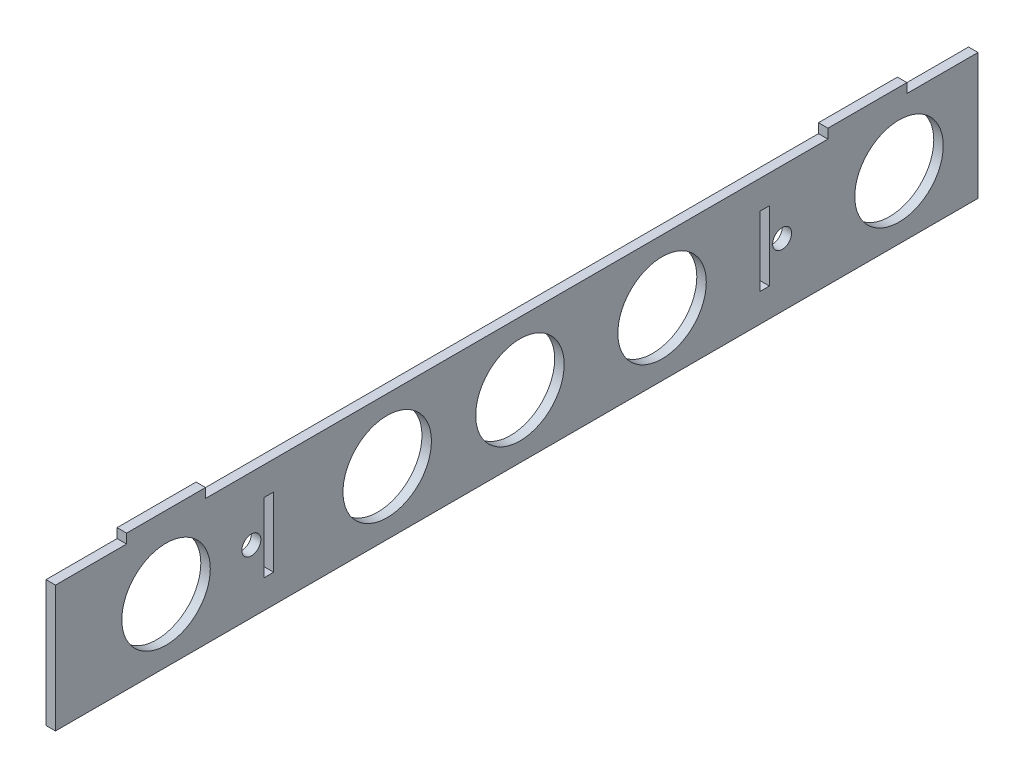
ISO-10303-21;
HEADER;
FILE_DESCRIPTION(('STEP AP214'),'2;1');
FILE_NAME('part.step','',(''),(''),'','','');
FILE_SCHEMA(('AUTOMOTIVE_DESIGN { 1 0 10303 214 1 1 1 1 }'));
ENDSEC;
DATA;
#1=APPLICATION_CONTEXT('core data for automotive mechanical design processes');
#2=APPLICATION_PROTOCOL_DEFINITION('international standard','automotive_design',2000,#1);
#3=PRODUCT_CONTEXT('',#1,'mechanical');
#4=PRODUCT('Part','Part','',(#3));
#5=PRODUCT_RELATED_PRODUCT_CATEGORY('part','',(#4));
#6=PRODUCT_DEFINITION_FORMATION('','',#4);
#7=PRODUCT_DEFINITION_CONTEXT('part definition',#1,'design');
#8=PRODUCT_DEFINITION('design','',#6,#7);
#9=PRODUCT_DEFINITION_SHAPE('','',#8);
#10=(LENGTH_UNIT() NAMED_UNIT(*) SI_UNIT(.MILLI.,.METRE.));
#11=(NAMED_UNIT(*) PLANE_ANGLE_UNIT() SI_UNIT($,.RADIAN.));
#12=(NAMED_UNIT(*) SI_UNIT($,.STERADIAN.) SOLID_ANGLE_UNIT());
#13=UNCERTAINTY_MEASURE_WITH_UNIT(LENGTH_MEASURE(1.E-05),#10,'distance_accuracy_value','');
#14=(GEOMETRIC_REPRESENTATION_CONTEXT(3) GLOBAL_UNCERTAINTY_ASSIGNED_CONTEXT((#13)) GLOBAL_UNIT_ASSIGNED_CONTEXT((#10,
#11,#12)) REPRESENTATION_CONTEXT('',''));
#15=CARTESIAN_POINT('',(0.,0.,0.));
#16=DIRECTION('',(0.,0.,1.));
#17=DIRECTION('',(1.,0.,0.));
#18=AXIS2_PLACEMENT_3D('',#15,#16,#17);
#19=CARTESIAN_POINT('',(3.,-9.,0.));
#20=DIRECTION('',(0.,1.,0.));
#21=DIRECTION('',(0.,0.,1.));
#22=AXIS2_PLACEMENT_3D('',#19,#20,#21);
#23=PLANE('',#22);
#24=DIRECTION('',(0.,0.,-1.));
#25=VECTOR('',#24,1.);
#26=CARTESIAN_POINT('',(0.,-9.,0.));
#27=LINE('',#26,#25);
#28=CARTESIAN_POINT('',(0.,-9.,-222.96));
#29=VERTEX_POINT('',#28);
#30=CARTESIAN_POINT('',(0.,-9.,-225.96));
#31=VERTEX_POINT('',#30);
#32=EDGE_CURVE('E273',#29,#31,#27,.T.);
#33=ORIENTED_EDGE('',*,*,#32,.T.);
#34=DIRECTION('',(-1.,0.,0.));
#35=VECTOR('',#34,1.);
#36=CARTESIAN_POINT('',(3.,-9.,-225.96));
#37=LINE('',#36,#35);
#38=CARTESIAN_POINT('',(3.,-9.,-225.96));
#39=VERTEX_POINT('',#38);
#40=EDGE_CURVE('E11',#39,#31,#37,.T.);
#41=ORIENTED_EDGE('',*,*,#40,.F.);
#42=DIRECTION('',(0.,0.,-1.));
#43=VECTOR('',#42,1.);
#44=CARTESIAN_POINT('',(3.,-9.,0.));
#45=LINE('',#44,#43);
#46=CARTESIAN_POINT('',(3.,-9.,-222.96));
#47=VERTEX_POINT('',#46);
#48=EDGE_CURVE('E194',#47,#39,#45,.T.);
#49=ORIENTED_EDGE('',*,*,#48,.F.);
#50=DIRECTION('',(-1.,0.,0.));
#51=VECTOR('',#50,1.);
#52=CARTESIAN_POINT('',(3.,-9.,-222.96));
#53=LINE('',#52,#51);
#54=EDGE_CURVE('E61',#47,#29,#53,.T.);
#55=ORIENTED_EDGE('',*,*,#54,.T.);
#56=EDGE_LOOP('',(#33,#41,#49,#55));
#57=FACE_BOUND('',#56,.T.);
#58=ADVANCED_FACE('F41',(#57),#23,.F.);
#59=CARTESIAN_POINT('',(3.,0.,-225.96));
#60=DIRECTION('',(0.,0.,-1.));
#61=DIRECTION('',(-1.,0.,0.));
#62=AXIS2_PLACEMENT_3D('',#59,#60,#61);
#63=PLANE('',#62);
#64=DIRECTION('',(0.,-1.,0.));
#65=VECTOR('',#64,1.);
#66=CARTESIAN_POINT('',(0.,0.,-225.96));
#67=LINE('',#66,#65);
#68=CARTESIAN_POINT('',(0.,-31.,-225.96));
#69=VERTEX_POINT('',#68);
#70=EDGE_CURVE('E201',#31,#69,#67,.T.);
#71=ORIENTED_EDGE('',*,*,#70,.T.);
#72=DIRECTION('',(-1.,0.,0.));
#73=VECTOR('',#72,1.);
#74=CARTESIAN_POINT('',(3.,-31.,-225.96));
#75=LINE('',#74,#73);
#76=CARTESIAN_POINT('',(3.,-31.,-225.96));
#77=VERTEX_POINT('',#76);
#78=EDGE_CURVE('E52',#77,#69,#75,.T.);
#79=ORIENTED_EDGE('',*,*,#78,.F.);
#80=DIRECTION('',(0.,-1.,0.));
#81=VECTOR('',#80,1.);
#82=CARTESIAN_POINT('',(3.,0.,-225.96));
#83=LINE('',#82,#81);
#84=EDGE_CURVE('E188',#39,#77,#83,.T.);
#85=ORIENTED_EDGE('',*,*,#84,.F.);
#86=ORIENTED_EDGE('',*,*,#40,.T.);
#87=EDGE_LOOP('',(#71,#79,#85,#86));
#88=FACE_BOUND('',#87,.T.);
#89=ADVANCED_FACE('F200',(#88),#63,.F.);
#90=CARTESIAN_POINT('',(3.,-31.,0.));
#91=DIRECTION('',(0.,1.,0.));
#92=DIRECTION('',(0.,0.,1.));
#93=AXIS2_PLACEMENT_3D('',#90,#91,#92);
#94=PLANE('',#93);
#95=DIRECTION('',(0.,0.,-1.));
#96=VECTOR('',#95,1.);
#97=CARTESIAN_POINT('',(0.,-31.,0.));
#98=LINE('',#97,#96);
#99=CARTESIAN_POINT('',(0.,-31.,-222.96));
#100=VERTEX_POINT('',#99);
#101=EDGE_CURVE('E278',#100,#69,#98,.T.);
#102=ORIENTED_EDGE('',*,*,#101,.F.);
#103=DIRECTION('',(-1.,0.,0.));
#104=VECTOR('',#103,1.);
#105=CARTESIAN_POINT('',(3.,-31.,-222.96));
#106=LINE('',#105,#104);
#107=CARTESIAN_POINT('',(3.,-31.,-222.96));
#108=VERTEX_POINT('',#107);
#109=EDGE_CURVE('E123',#108,#100,#106,.T.);
#110=ORIENTED_EDGE('',*,*,#109,.F.);
#111=DIRECTION('',(0.,0.,-1.));
#112=VECTOR('',#111,1.);
#113=CARTESIAN_POINT('',(3.,-31.,0.));
#114=LINE('',#113,#112);
#115=EDGE_CURVE('E193',#108,#77,#114,.T.);
#116=ORIENTED_EDGE('',*,*,#115,.T.);
#117=ORIENTED_EDGE('',*,*,#78,.T.);
#118=EDGE_LOOP('',(#102,#110,#116,#117));
#119=FACE_BOUND('',#118,.T.);
#120=ADVANCED_FACE('F206',(#119),#94,.T.);
#121=CARTESIAN_POINT('',(3.,-9.,0.));
#122=DIRECTION('',(0.,1.,0.));
#123=DIRECTION('',(0.,0.,1.));
#124=AXIS2_PLACEMENT_3D('',#121,#122,#123);
#125=PLANE('',#124);
#126=DIRECTION('',(0.,0.,-1.));
#127=VECTOR('',#126,1.);
#128=CARTESIAN_POINT('',(0.,-9.,0.));
#129=LINE('',#128,#127);
#130=CARTESIAN_POINT('',(0.,-9.,-66.04));
#131=VERTEX_POINT('',#130);
#132=CARTESIAN_POINT('',(0.,-9.,-69.04));
#133=VERTEX_POINT('',#132);
#134=EDGE_CURVE('E257',#131,#133,#129,.T.);
#135=ORIENTED_EDGE('',*,*,#134,.T.);
#136=DIRECTION('',(-1.,0.,0.));
#137=VECTOR('',#136,1.);
#138=CARTESIAN_POINT('',(3.,-9.,-69.04));
#139=LINE('',#138,#137);
#140=CARTESIAN_POINT('',(3.,-9.,-69.04));
#141=VERTEX_POINT('',#140);
#142=EDGE_CURVE('E288',#141,#133,#139,.T.);
#143=ORIENTED_EDGE('',*,*,#142,.F.);
#144=DIRECTION('',(0.,0.,-1.));
#145=VECTOR('',#144,1.);
#146=CARTESIAN_POINT('',(3.,-9.,0.));
#147=LINE('',#146,#145);
#148=CARTESIAN_POINT('',(3.,-9.,-66.04));
#149=VERTEX_POINT('',#148);
#150=EDGE_CURVE('E430',#149,#141,#147,.T.);
#151=ORIENTED_EDGE('',*,*,#150,.F.);
#152=DIRECTION('',(-1.,0.,0.));
#153=VECTOR('',#152,1.);
#154=CARTESIAN_POINT('',(3.,-9.,-66.04));
#155=LINE('',#154,#153);
#156=EDGE_CURVE('E291',#149,#131,#155,.T.);
#157=ORIENTED_EDGE('',*,*,#156,.T.);
#158=EDGE_LOOP('',(#135,#143,#151,#157));
#159=FACE_BOUND('',#158,.T.);
#160=ADVANCED_FACE('F532',(#159),#125,.F.);
#161=CARTESIAN_POINT('',(3.,0.,-69.04));
#162=DIRECTION('',(0.,0.,-1.));
#163=DIRECTION('',(-1.,0.,0.));
#164=AXIS2_PLACEMENT_3D('',#161,#162,#163);
#165=PLANE('',#164);
#166=DIRECTION('',(0.,-1.,0.));
#167=VECTOR('',#166,1.);
#168=CARTESIAN_POINT('',(0.,0.,-69.04));
#169=LINE('',#168,#167);
#170=CARTESIAN_POINT('',(0.,-31.,-69.04));
#171=VERTEX_POINT('',#170);
#172=EDGE_CURVE('E261',#133,#171,#169,.T.);
#173=ORIENTED_EDGE('',*,*,#172,.T.);
#174=DIRECTION('',(-1.,0.,0.));
#175=VECTOR('',#174,1.);
#176=CARTESIAN_POINT('',(3.,-31.,-69.04));
#177=LINE('',#176,#175);
#178=CARTESIAN_POINT('',(3.,-31.,-69.04));
#179=VERTEX_POINT('',#178);
#180=EDGE_CURVE('E297',#179,#171,#177,.T.);
#181=ORIENTED_EDGE('',*,*,#180,.F.);
#182=DIRECTION('',(0.,-1.,0.));
#183=VECTOR('',#182,1.);
#184=CARTESIAN_POINT('',(3.,0.,-69.04));
#185=LINE('',#184,#183);
#186=EDGE_CURVE('E434',#141,#179,#185,.T.);
#187=ORIENTED_EDGE('',*,*,#186,.F.);
#188=ORIENTED_EDGE('',*,*,#142,.T.);
#189=EDGE_LOOP('',(#173,#181,#187,#188));
#190=FACE_BOUND('',#189,.T.);
#191=ADVANCED_FACE('F528',(#190),#165,.F.);
#192=CARTESIAN_POINT('',(3.,-31.,0.));
#193=DIRECTION('',(0.,1.,0.));
#194=DIRECTION('',(0.,0.,1.));
#195=AXIS2_PLACEMENT_3D('',#192,#193,#194);
#196=PLANE('',#195);
#197=DIRECTION('',(0.,0.,-1.));
#198=VECTOR('',#197,1.);
#199=CARTESIAN_POINT('',(0.,-31.,0.));
#200=LINE('',#199,#198);
#201=CARTESIAN_POINT('',(0.,-31.,-66.04));
#202=VERTEX_POINT('',#201);
#203=EDGE_CURVE('E265',#202,#171,#200,.T.);
#204=ORIENTED_EDGE('',*,*,#203,.F.);
#205=DIRECTION('',(-1.,0.,0.));
#206=VECTOR('',#205,1.);
#207=CARTESIAN_POINT('',(3.,-31.,-66.04));
#208=LINE('',#207,#206);
#209=CARTESIAN_POINT('',(3.,-31.,-66.04));
#210=VERTEX_POINT('',#209);
#211=EDGE_CURVE('E294',#210,#202,#208,.T.);
#212=ORIENTED_EDGE('',*,*,#211,.F.);
#213=DIRECTION('',(0.,0.,-1.));
#214=VECTOR('',#213,1.);
#215=CARTESIAN_POINT('',(3.,-31.,0.));
#216=LINE('',#215,#214);
#217=EDGE_CURVE('E437',#210,#179,#216,.T.);
#218=ORIENTED_EDGE('',*,*,#217,.T.);
#219=ORIENTED_EDGE('',*,*,#180,.T.);
#220=EDGE_LOOP('',(#204,#212,#218,#219));
#221=FACE_BOUND('',#220,.T.);
#222=ADVANCED_FACE('F525',(#221),#196,.T.);
#223=CARTESIAN_POINT('',(3.,0.,-292.));
#224=DIRECTION('',(0.,0.,-1.));
#225=DIRECTION('',(-1.,0.,0.));
#226=AXIS2_PLACEMENT_3D('',#223,#224,#225);
#227=PLANE('',#226);
#228=DIRECTION('',(0.,-1.,0.));
#229=VECTOR('',#228,1.);
#230=CARTESIAN_POINT('',(0.,0.,-292.));
#231=LINE('',#230,#229);
#232=CARTESIAN_POINT('',(0.,0.,-292.));
#233=VERTEX_POINT('',#232);
#234=CARTESIAN_POINT('',(0.,-40.,-292.));
#235=VERTEX_POINT('',#234);
#236=EDGE_CURVE('E215',#233,#235,#231,.T.);
#237=ORIENTED_EDGE('',*,*,#236,.F.);
#238=DIRECTION('',(-1.,0.,0.));
#239=VECTOR('',#238,1.);
#240=CARTESIAN_POINT('',(3.,0.,-292.));
#241=LINE('',#240,#239);
#242=CARTESIAN_POINT('',(3.,0.,-292.));
#243=VERTEX_POINT('',#242);
#244=EDGE_CURVE('E135',#243,#233,#241,.T.);
#245=ORIENTED_EDGE('',*,*,#244,.F.);
#246=DIRECTION('',(0.,-1.,0.));
#247=VECTOR('',#246,1.);
#248=CARTESIAN_POINT('',(3.,0.,-292.));
#249=LINE('',#248,#247);
#250=CARTESIAN_POINT('',(3.,-40.,-292.));
#251=VERTEX_POINT('',#250);
#252=EDGE_CURVE('E285',#243,#251,#249,.T.);
#253=ORIENTED_EDGE('',*,*,#252,.T.);
#254=DIRECTION('',(-1.,0.,0.));
#255=VECTOR('',#254,1.);
#256=CARTESIAN_POINT('',(3.,-40.,-292.));
#257=LINE('',#256,#255);
#258=EDGE_CURVE('E211',#251,#235,#257,.T.);
#259=ORIENTED_EDGE('',*,*,#258,.T.);
#260=EDGE_LOOP('',(#237,#245,#253,#259));
#261=FACE_BOUND('',#260,.T.);
#262=ADVANCED_FACE('F43',(#261),#227,.T.);
#263=CARTESIAN_POINT('',(3.,0.,0.));
#264=DIRECTION('',(0.,1.,0.));
#265=DIRECTION('',(0.,0.,1.));
#266=AXIS2_PLACEMENT_3D('',#263,#264,#265);
#267=PLANE('',#266);
#268=DIRECTION('',(0.,0.,-1.));
#269=VECTOR('',#268,1.);
#270=CARTESIAN_POINT('',(0.,0.,0.));
#271=LINE('',#270,#269);
#272=CARTESIAN_POINT('',(0.,0.,-269.5));
#273=VERTEX_POINT('',#272);
#274=EDGE_CURVE('E219',#273,#233,#271,.T.);
#275=ORIENTED_EDGE('',*,*,#274,.F.);
#276=DIRECTION('',(-1.,0.,0.));
#277=VECTOR('',#276,1.);
#278=CARTESIAN_POINT('',(3.,0.,-269.5));
#279=LINE('',#278,#277);
#280=CARTESIAN_POINT('',(3.,0.,-269.5));
#281=VERTEX_POINT('',#280);
#282=EDGE_CURVE('E333',#281,#273,#279,.T.);
#283=ORIENTED_EDGE('',*,*,#282,.F.);
#284=DIRECTION('',(0.,0.,-1.));
#285=VECTOR('',#284,1.);
#286=CARTESIAN_POINT('',(3.,0.,0.));
#287=LINE('',#286,#285);
#288=EDGE_CURVE('E396',#281,#243,#287,.T.);
#289=ORIENTED_EDGE('',*,*,#288,.T.);
#290=ORIENTED_EDGE('',*,*,#244,.T.);
#291=EDGE_LOOP('',(#275,#283,#289,#290));
#292=FACE_BOUND('',#291,.T.);
#293=ADVANCED_FACE('F475',(#292),#267,.T.);
#294=CARTESIAN_POINT('',(3.,0.,-269.5));
#295=DIRECTION('',(0.,0.,1.));
#296=DIRECTION('',(1.,0.,0.));
#297=AXIS2_PLACEMENT_3D('',#294,#295,#296);
#298=PLANE('',#297);
#299=DIRECTION('',(0.,1.,0.));
#300=VECTOR('',#299,1.);
#301=CARTESIAN_POINT('',(0.,0.,-269.5));
#302=LINE('',#301,#300);
#303=CARTESIAN_POINT('',(0.,3.,-269.5));
#304=VERTEX_POINT('',#303);
#305=EDGE_CURVE('E224',#273,#304,#302,.T.);
#306=ORIENTED_EDGE('',*,*,#305,.T.);
#307=DIRECTION('',(-1.,0.,0.));
#308=VECTOR('',#307,1.);
#309=CARTESIAN_POINT('',(3.,3.,-269.5));
#310=LINE('',#309,#308);
#311=CARTESIAN_POINT('',(3.,3.,-269.5));
#312=VERTEX_POINT('',#311);
#313=EDGE_CURVE('E330',#312,#304,#310,.T.);
#314=ORIENTED_EDGE('',*,*,#313,.F.);
#315=DIRECTION('',(0.,1.,0.));
#316=VECTOR('',#315,1.);
#317=CARTESIAN_POINT('',(3.,0.,-269.5));
#318=LINE('',#317,#316);
#319=EDGE_CURVE('E400',#281,#312,#318,.T.);
#320=ORIENTED_EDGE('',*,*,#319,.F.);
#321=ORIENTED_EDGE('',*,*,#282,.T.);
#322=EDGE_LOOP('',(#306,#314,#320,#321));
#323=FACE_BOUND('',#322,.T.);
#324=ADVANCED_FACE('F505',(#323),#298,.F.);
#325=CARTESIAN_POINT('',(3.,2.99999999999997,0.));
#326=DIRECTION('',(0.,1.,0.));
#327=DIRECTION('',(0.,0.,1.));
#328=AXIS2_PLACEMENT_3D('',#325,#326,#327);
#329=PLANE('',#328);
#330=DIRECTION('',(0.,0.,-1.));
#331=VECTOR('',#330,1.);
#332=CARTESIAN_POINT('',(0.,2.99999999999997,0.));
#333=LINE('',#332,#331);
#334=CARTESIAN_POINT('',(0.,3.,-244.5));
#335=VERTEX_POINT('',#334);
#336=EDGE_CURVE('E230',#335,#304,#333,.T.);
#337=ORIENTED_EDGE('',*,*,#336,.F.);
#338=DIRECTION('',(-1.,0.,0.));
#339=VECTOR('',#338,1.);
#340=CARTESIAN_POINT('',(3.,3.,-244.5));
#341=LINE('',#340,#339);
#342=CARTESIAN_POINT('',(3.,3.,-244.5));
#343=VERTEX_POINT('',#342);
#344=EDGE_CURVE('E327',#343,#335,#341,.T.);
#345=ORIENTED_EDGE('',*,*,#344,.F.);
#346=DIRECTION('',(0.,0.,-1.));
#347=VECTOR('',#346,1.);
#348=CARTESIAN_POINT('',(3.,2.99999999999997,0.));
#349=LINE('',#348,#347);
#350=EDGE_CURVE('E405',#343,#312,#349,.T.);
#351=ORIENTED_EDGE('',*,*,#350,.T.);
#352=ORIENTED_EDGE('',*,*,#313,.T.);
#353=EDGE_LOOP('',(#337,#345,#351,#352));
#354=FACE_BOUND('',#353,.T.);
#355=ADVANCED_FACE('F469',(#354),#329,.T.);
#356=CARTESIAN_POINT('',(3.,0.,-244.5));
#357=DIRECTION('',(0.,0.,1.));
#358=DIRECTION('',(1.,0.,0.));
#359=AXIS2_PLACEMENT_3D('',#356,#357,#358);
#360=PLANE('',#359);
#361=DIRECTION('',(0.,1.,0.));
#362=VECTOR('',#361,1.);
#363=CARTESIAN_POINT('',(0.,0.,-244.5));
#364=LINE('',#363,#362);
#365=CARTESIAN_POINT('',(0.,0.,-244.5));
#366=VERTEX_POINT('',#365);
#367=EDGE_CURVE('E234',#366,#335,#364,.T.);
#368=ORIENTED_EDGE('',*,*,#367,.F.);
#369=DIRECTION('',(-1.,0.,0.));
#370=VECTOR('',#369,1.);
#371=CARTESIAN_POINT('',(3.,0.,-244.5));
#372=LINE('',#371,#370);
#373=CARTESIAN_POINT('',(3.,0.,-244.5));
#374=VERTEX_POINT('',#373);
#375=EDGE_CURVE('E324',#374,#366,#372,.T.);
#376=ORIENTED_EDGE('',*,*,#375,.F.);
#377=DIRECTION('',(0.,1.,0.));
#378=VECTOR('',#377,1.);
#379=CARTESIAN_POINT('',(3.,0.,-244.5));
#380=LINE('',#379,#378);
#381=EDGE_CURVE('E409',#374,#343,#380,.T.);
#382=ORIENTED_EDGE('',*,*,#381,.T.);
#383=ORIENTED_EDGE('',*,*,#344,.T.);
#384=EDGE_LOOP('',(#368,#376,#382,#383));
#385=FACE_BOUND('',#384,.T.);
#386=ADVANCED_FACE('F465',(#385),#360,.T.);
#387=CARTESIAN_POINT('',(0.,0.,-47.5));
#388=VERTEX_POINT('',#387);
#389=EDGE_CURVE('E226',#388,#366,#271,.T.);
#390=ORIENTED_EDGE('',*,*,#389,.F.);
#391=DIRECTION('',(-1.,0.,0.));
#392=VECTOR('',#391,1.);
#393=CARTESIAN_POINT('',(3.,0.,-47.5));
#394=LINE('',#393,#392);
#395=CARTESIAN_POINT('',(3.,0.,-47.5));
#396=VERTEX_POINT('',#395);
#397=EDGE_CURVE('E321',#396,#388,#394,.T.);
#398=ORIENTED_EDGE('',*,*,#397,.F.);
#399=EDGE_CURVE('E402',#396,#374,#287,.T.);
#400=ORIENTED_EDGE('',*,*,#399,.T.);
#401=ORIENTED_EDGE('',*,*,#375,.T.);
#402=EDGE_LOOP('',(#390,#398,#400,#401));
#403=FACE_BOUND('',#402,.T.);
#404=ADVANCED_FACE('F460',(#403),#267,.T.);
#405=CARTESIAN_POINT('',(3.,0.,-47.5));
#406=DIRECTION('',(0.,0.,1.));
#407=DIRECTION('',(1.,0.,0.));
#408=AXIS2_PLACEMENT_3D('',#405,#406,#407);
#409=PLANE('',#408);
#410=DIRECTION('',(0.,1.,0.));
#411=VECTOR('',#410,1.);
#412=CARTESIAN_POINT('',(0.,0.,-47.5));
#413=LINE('',#412,#411);
#414=CARTESIAN_POINT('',(0.,3.,-47.5));
#415=VERTEX_POINT('',#414);
#416=EDGE_CURVE('E238',#388,#415,#413,.T.);
#417=ORIENTED_EDGE('',*,*,#416,.T.);
#418=DIRECTION('',(-1.,0.,0.));
#419=VECTOR('',#418,1.);
#420=CARTESIAN_POINT('',(3.,3.,-47.5));
#421=LINE('',#420,#419);
#422=CARTESIAN_POINT('',(3.,3.,-47.5));
#423=VERTEX_POINT('',#422);
#424=EDGE_CURVE('E318',#423,#415,#421,.T.);
#425=ORIENTED_EDGE('',*,*,#424,.F.);
#426=DIRECTION('',(0.,1.,0.));
#427=VECTOR('',#426,1.);
#428=CARTESIAN_POINT('',(3.,0.,-47.5));
#429=LINE('',#428,#427);
#430=EDGE_CURVE('E413',#396,#423,#429,.T.);
#431=ORIENTED_EDGE('',*,*,#430,.F.);
#432=ORIENTED_EDGE('',*,*,#397,.T.);
#433=EDGE_LOOP('',(#417,#425,#431,#432));
#434=FACE_BOUND('',#433,.T.);
#435=ADVANCED_FACE('F502',(#434),#409,.F.);
#436=CARTESIAN_POINT('',(3.,3.,0.));
#437=DIRECTION('',(0.,1.,0.));
#438=DIRECTION('',(0.,0.,1.));
#439=AXIS2_PLACEMENT_3D('',#436,#437,#438);
#440=PLANE('',#439);
#441=DIRECTION('',(0.,0.,-1.));
#442=VECTOR('',#441,1.);
#443=CARTESIAN_POINT('',(0.,3.,0.));
#444=LINE('',#443,#442);
#445=CARTESIAN_POINT('',(0.,3.,-22.5));
#446=VERTEX_POINT('',#445);
#447=EDGE_CURVE('E242',#446,#415,#444,.T.);
#448=ORIENTED_EDGE('',*,*,#447,.F.);
#449=DIRECTION('',(-1.,0.,0.));
#450=VECTOR('',#449,1.);
#451=CARTESIAN_POINT('',(3.,3.,-22.5));
#452=LINE('',#451,#450);
#453=CARTESIAN_POINT('',(3.,3.,-22.5));
#454=VERTEX_POINT('',#453);
#455=EDGE_CURVE('E315',#454,#446,#452,.T.);
#456=ORIENTED_EDGE('',*,*,#455,.F.);
#457=DIRECTION('',(0.,0.,-1.));
#458=VECTOR('',#457,1.);
#459=CARTESIAN_POINT('',(3.,3.,0.));
#460=LINE('',#459,#458);
#461=EDGE_CURVE('E416',#454,#423,#460,.T.);
#462=ORIENTED_EDGE('',*,*,#461,.T.);
#463=ORIENTED_EDGE('',*,*,#424,.T.);
#464=EDGE_LOOP('',(#448,#456,#462,#463));
#465=FACE_BOUND('',#464,.T.);
#466=ADVANCED_FACE('F499',(#465),#440,.T.);
#467=CARTESIAN_POINT('',(3.,0.,-22.5));
#468=DIRECTION('',(0.,0.,1.));
#469=DIRECTION('',(1.,0.,0.));
#470=AXIS2_PLACEMENT_3D('',#467,#468,#469);
#471=PLANE('',#470);
#472=DIRECTION('',(0.,1.,0.));
#473=VECTOR('',#472,1.);
#474=CARTESIAN_POINT('',(0.,0.,-22.5));
#475=LINE('',#474,#473);
#476=CARTESIAN_POINT('',(0.,0.,-22.5));
#477=VERTEX_POINT('',#476);
#478=EDGE_CURVE('E246',#477,#446,#475,.T.);
#479=ORIENTED_EDGE('',*,*,#478,.F.);
#480=DIRECTION('',(-1.,0.,0.));
#481=VECTOR('',#480,1.);
#482=CARTESIAN_POINT('',(3.,0.,-22.5));
#483=LINE('',#482,#481);
#484=CARTESIAN_POINT('',(3.,0.,-22.5));
#485=VERTEX_POINT('',#484);
#486=EDGE_CURVE('E312',#485,#477,#483,.T.);
#487=ORIENTED_EDGE('',*,*,#486,.F.);
#488=DIRECTION('',(0.,1.,0.));
#489=VECTOR('',#488,1.);
#490=CARTESIAN_POINT('',(3.,0.,-22.5));
#491=LINE('',#490,#489);
#492=EDGE_CURVE('E420',#485,#454,#491,.T.);
#493=ORIENTED_EDGE('',*,*,#492,.T.);
#494=ORIENTED_EDGE('',*,*,#455,.T.);
#495=EDGE_LOOP('',(#479,#487,#493,#494));
#496=FACE_BOUND('',#495,.T.);
#497=ADVANCED_FACE('F495',(#496),#471,.T.);
#498=CARTESIAN_POINT('',(0.,0.,0.));
#499=VERTEX_POINT('',#498);
#500=EDGE_CURVE('E225',#499,#477,#271,.T.);
#501=ORIENTED_EDGE('',*,*,#500,.F.);
#502=DIRECTION('',(-1.,0.,0.));
#503=VECTOR('',#502,1.);
#504=CARTESIAN_POINT('',(3.,0.,0.));
#505=LINE('',#504,#503);
#506=CARTESIAN_POINT('',(3.,0.,0.));
#507=VERTEX_POINT('',#506);
#508=EDGE_CURVE('E309',#507,#499,#505,.T.);
#509=ORIENTED_EDGE('',*,*,#508,.F.);
#510=EDGE_CURVE('E401',#507,#485,#287,.T.);
#511=ORIENTED_EDGE('',*,*,#510,.T.);
#512=ORIENTED_EDGE('',*,*,#486,.T.);
#513=EDGE_LOOP('',(#501,#509,#511,#512));
#514=FACE_BOUND('',#513,.T.);
#515=ADVANCED_FACE('F491',(#514),#267,.T.);
#516=CARTESIAN_POINT('',(3.,0.,0.));
#517=DIRECTION('',(0.,0.,-1.));
#518=DIRECTION('',(-1.,0.,0.));
#519=AXIS2_PLACEMENT_3D('',#516,#517,#518);
#520=PLANE('',#519);
#521=DIRECTION('',(0.,-1.,0.));
#522=VECTOR('',#521,1.);
#523=CARTESIAN_POINT('',(0.,0.,0.));
#524=LINE('',#523,#522);
#525=CARTESIAN_POINT('',(0.,-40.,0.));
#526=VERTEX_POINT('',#525);
#527=EDGE_CURVE('E250',#499,#526,#524,.T.);
#528=ORIENTED_EDGE('',*,*,#527,.T.);
#529=DIRECTION('',(-1.,0.,0.));
#530=VECTOR('',#529,1.);
#531=CARTESIAN_POINT('',(3.,-40.,0.));
#532=LINE('',#531,#530);
#533=CARTESIAN_POINT('',(3.,-40.,0.));
#534=VERTEX_POINT('',#533);
#535=EDGE_CURVE('E305',#534,#526,#532,.T.);
#536=ORIENTED_EDGE('',*,*,#535,.F.);
#537=DIRECTION('',(0.,-1.,0.));
#538=VECTOR('',#537,1.);
#539=CARTESIAN_POINT('',(3.,0.,0.));
#540=LINE('',#539,#538);
#541=EDGE_CURVE('E424',#507,#534,#540,.T.);
#542=ORIENTED_EDGE('',*,*,#541,.F.);
#543=ORIENTED_EDGE('',*,*,#508,.T.);
#544=EDGE_LOOP('',(#528,#536,#542,#543));
#545=FACE_BOUND('',#544,.T.);
#546=ADVANCED_FACE('F488',(#545),#520,.F.);
#547=CARTESIAN_POINT('',(3.,0.,-66.04));
#548=DIRECTION('',(0.,0.,-1.));
#549=DIRECTION('',(-1.,0.,0.));
#550=AXIS2_PLACEMENT_3D('',#547,#548,#549);
#551=PLANE('',#550);
#552=DIRECTION('',(0.,-1.,0.));
#553=VECTOR('',#552,1.);
#554=CARTESIAN_POINT('',(0.,0.,-66.04));
#555=LINE('',#554,#553);
#556=EDGE_CURVE('E269',#131,#202,#555,.T.);
#557=ORIENTED_EDGE('',*,*,#556,.F.);
#558=ORIENTED_EDGE('',*,*,#156,.F.);
#559=DIRECTION('',(0.,-1.,0.));
#560=VECTOR('',#559,1.);
#561=CARTESIAN_POINT('',(3.,0.,-66.04));
#562=LINE('',#561,#560);
#563=EDGE_CURVE('E441',#149,#210,#562,.T.);
#564=ORIENTED_EDGE('',*,*,#563,.T.);
#565=ORIENTED_EDGE('',*,*,#211,.T.);
#566=EDGE_LOOP('',(#557,#558,#564,#565));
#567=FACE_BOUND('',#566,.T.);
#568=ADVANCED_FACE('F521',(#567),#551,.T.);
#569=CARTESIAN_POINT('',(3.,-40.,0.));
#570=DIRECTION('',(0.,1.,0.));
#571=DIRECTION('',(0.,0.,1.));
#572=AXIS2_PLACEMENT_3D('',#569,#570,#571);
#573=PLANE('',#572);
#574=DIRECTION('',(0.,0.,-1.));
#575=VECTOR('',#574,1.);
#576=CARTESIAN_POINT('',(0.,-40.,0.));
#577=LINE('',#576,#575);
#578=EDGE_CURVE('E253',#526,#235,#577,.T.);
#579=ORIENTED_EDGE('',*,*,#578,.T.);
#580=ORIENTED_EDGE('',*,*,#258,.F.);
#581=DIRECTION('',(0.,0.,-1.));
#582=VECTOR('',#581,1.);
#583=CARTESIAN_POINT('',(3.,-40.,0.));
#584=LINE('',#583,#582);
#585=EDGE_CURVE('E427',#534,#251,#584,.T.);
#586=ORIENTED_EDGE('',*,*,#585,.F.);
#587=ORIENTED_EDGE('',*,*,#535,.T.);
#588=EDGE_LOOP('',(#579,#580,#586,#587));
#589=FACE_BOUND('',#588,.T.);
#590=ADVANCED_FACE('F483',(#589),#573,.F.);
#591=CARTESIAN_POINT('',(3.,0.,-222.96));
#592=DIRECTION('',(0.,0.,-1.));
#593=DIRECTION('',(-1.,0.,0.));
#594=AXIS2_PLACEMENT_3D('',#591,#592,#593);
#595=PLANE('',#594);
#596=DIRECTION('',(0.,-1.,0.));
#597=VECTOR('',#596,1.);
#598=CARTESIAN_POINT('',(0.,0.,-222.96));
#599=LINE('',#598,#597);
#600=EDGE_CURVE('E281',#29,#100,#599,.T.);
#601=ORIENTED_EDGE('',*,*,#600,.F.);
#602=ORIENTED_EDGE('',*,*,#54,.F.);
#603=DIRECTION('',(0.,-1.,0.));
#604=VECTOR('',#603,1.);
#605=CARTESIAN_POINT('',(3.,0.,-222.96));
#606=LINE('',#605,#604);
#607=EDGE_CURVE('E208',#47,#108,#606,.T.);
#608=ORIENTED_EDGE('',*,*,#607,.T.);
#609=ORIENTED_EDGE('',*,*,#109,.T.);
#610=EDGE_LOOP('',(#601,#602,#608,#609));
#611=FACE_BOUND('',#610,.T.);
#612=ADVANCED_FACE('F539',(#611),#595,.T.);
#613=CARTESIAN_POINT('',(3.,0.,0.));
#614=DIRECTION('',(1.,0.,0.));
#615=DIRECTION('',(0.,0.,-1.));
#616=AXIS2_PLACEMENT_3D('',#613,#614,#615);
#617=PLANE('',#616);
#618=CARTESIAN_POINT('',(3.,-20.,-62.));
#619=DIRECTION('',(1.,0.,0.));
#620=DIRECTION('',(0.,0.,-1.));
#621=AXIS2_PLACEMENT_3D('',#618,#619,#620);
#622=CIRCLE('',#621,3.00000000000001);
#623=CARTESIAN_POINT('',(3.,-20.,-65.));
#624=VERTEX_POINT('',#623);
#625=EDGE_CURVE('E360',#624,#624,#622,.T.);
#626=ORIENTED_EDGE('',*,*,#625,.F.);
#627=EDGE_LOOP('',(#626));
#628=FACE_BOUND('',#627,.T.);
#629=CARTESIAN_POINT('',(3.,-20.,-230.));
#630=DIRECTION('',(1.,0.,0.));
#631=DIRECTION('',(0.,0.,-1.));
#632=AXIS2_PLACEMENT_3D('',#629,#630,#631);
#633=CIRCLE('',#632,2.99999999999999);
#634=CARTESIAN_POINT('',(3.,-20.,-233.));
#635=VERTEX_POINT('',#634);
#636=EDGE_CURVE('E368',#635,#635,#633,.T.);
#637=ORIENTED_EDGE('',*,*,#636,.F.);
#638=EDGE_LOOP('',(#637));
#639=FACE_BOUND('',#638,.T.);
#640=CARTESIAN_POINT('',(3.,-20.,-35.));
#641=DIRECTION('',(1.,0.,0.));
#642=DIRECTION('',(0.,0.,-1.));
#643=AXIS2_PLACEMENT_3D('',#640,#641,#642);
#644=CIRCLE('',#643,14.);
#645=CARTESIAN_POINT('',(3.,-20.,-49.));
#646=VERTEX_POINT('',#645);
#647=EDGE_CURVE('E343',#646,#646,#644,.T.);
#648=ORIENTED_EDGE('',*,*,#647,.F.);
#649=EDGE_LOOP('',(#648));
#650=FACE_BOUND('',#649,.T.);
#651=CARTESIAN_POINT('',(3.,-20.,-105.));
#652=DIRECTION('',(1.,0.,0.));
#653=DIRECTION('',(0.,0.,-1.));
#654=AXIS2_PLACEMENT_3D('',#651,#652,#653);
#655=CIRCLE('',#654,14.);
#656=CARTESIAN_POINT('',(3.,-20.,-119.));
#657=VERTEX_POINT('',#656);
#658=EDGE_CURVE('E379',#657,#657,#655,.T.);
#659=ORIENTED_EDGE('',*,*,#658,.F.);
#660=EDGE_LOOP('',(#659));
#661=FACE_BOUND('',#660,.T.);
#662=CARTESIAN_POINT('',(3.,-20.,-147.));
#663=DIRECTION('',(1.,0.,0.));
#664=DIRECTION('',(0.,0.,-1.));
#665=AXIS2_PLACEMENT_3D('',#662,#663,#664);
#666=CIRCLE('',#665,14.);
#667=CARTESIAN_POINT('',(3.,-20.,-161.));
#668=VERTEX_POINT('',#667);
#669=EDGE_CURVE('E383',#668,#668,#666,.T.);
#670=ORIENTED_EDGE('',*,*,#669,.F.);
#671=EDGE_LOOP('',(#670));
#672=FACE_BOUND('',#671,.T.);
#673=CARTESIAN_POINT('',(3.,-20.,-192.));
#674=DIRECTION('',(1.,0.,0.));
#675=DIRECTION('',(0.,0.,-1.));
#676=AXIS2_PLACEMENT_3D('',#673,#674,#675);
#677=CIRCLE('',#676,14.);
#678=CARTESIAN_POINT('',(3.,-20.,-206.));
#679=VERTEX_POINT('',#678);
#680=EDGE_CURVE('E387',#679,#679,#677,.T.);
#681=ORIENTED_EDGE('',*,*,#680,.F.);
#682=EDGE_LOOP('',(#681));
#683=FACE_BOUND('',#682,.T.);
#684=CARTESIAN_POINT('',(3.,-20.,-267.));
#685=DIRECTION('',(1.,0.,0.));
#686=DIRECTION('',(0.,0.,-1.));
#687=AXIS2_PLACEMENT_3D('',#684,#685,#686);
#688=CIRCLE('',#687,14.);
#689=CARTESIAN_POINT('',(3.,-20.,-281.));
#690=VERTEX_POINT('',#689);
#691=EDGE_CURVE('E366',#690,#690,#688,.T.);
#692=ORIENTED_EDGE('',*,*,#691,.F.);
#693=EDGE_LOOP('',(#692));
#694=FACE_BOUND('',#693,.T.);
#695=ORIENTED_EDGE('',*,*,#252,.F.);
#696=ORIENTED_EDGE('',*,*,#288,.F.);
#697=ORIENTED_EDGE('',*,*,#319,.T.);
#698=ORIENTED_EDGE('',*,*,#350,.F.);
#699=ORIENTED_EDGE('',*,*,#381,.F.);
#700=ORIENTED_EDGE('',*,*,#399,.F.);
#701=ORIENTED_EDGE('',*,*,#430,.T.);
#702=ORIENTED_EDGE('',*,*,#461,.F.);
#703=ORIENTED_EDGE('',*,*,#492,.F.);
#704=ORIENTED_EDGE('',*,*,#510,.F.);
#705=ORIENTED_EDGE('',*,*,#541,.T.);
#706=ORIENTED_EDGE('',*,*,#585,.T.);
#707=EDGE_LOOP('',(#695,#696,#697,#698,#699,#700,#701,#702,#703,#704,#705,#706));
#708=FACE_BOUND('',#707,.T.);
#709=ORIENTED_EDGE('',*,*,#150,.T.);
#710=ORIENTED_EDGE('',*,*,#186,.T.);
#711=ORIENTED_EDGE('',*,*,#217,.F.);
#712=ORIENTED_EDGE('',*,*,#563,.F.);
#713=EDGE_LOOP('',(#709,#710,#711,#712));
#714=FACE_BOUND('',#713,.T.);
#715=ORIENTED_EDGE('',*,*,#48,.T.);
#716=ORIENTED_EDGE('',*,*,#84,.T.);
#717=ORIENTED_EDGE('',*,*,#115,.F.);
#718=ORIENTED_EDGE('',*,*,#607,.F.);
#719=EDGE_LOOP('',(#715,#716,#717,#718));
#720=FACE_BOUND('',#719,.T.);
#721=ADVANCED_FACE('F190',(#628,#639,#650,#661,#672,#683,#694,#708,#714,#720),#617,.T.);
#722=CARTESIAN_POINT('',(0.,0.,0.));
#723=DIRECTION('',(1.,0.,0.));
#724=DIRECTION('',(0.,0.,-1.));
#725=AXIS2_PLACEMENT_3D('',#722,#723,#724);
#726=PLANE('',#725);
#727=CARTESIAN_POINT('',(0.,-20.,-62.));
#728=DIRECTION('',(1.,0.,0.));
#729=DIRECTION('',(0.,0.,-1.));
#730=AXIS2_PLACEMENT_3D('',#727,#728,#729);
#731=CIRCLE('',#730,3.00000000000001);
#732=CARTESIAN_POINT('',(0.,-20.,-65.));
#733=VERTEX_POINT('',#732);
#734=EDGE_CURVE('E45',#733,#733,#731,.T.);
#735=ORIENTED_EDGE('',*,*,#734,.T.);
#736=EDGE_LOOP('',(#735));
#737=FACE_BOUND('',#736,.T.);
#738=CARTESIAN_POINT('',(0.,-20.,-230.));
#739=DIRECTION('',(1.,0.,0.));
#740=DIRECTION('',(0.,0.,-1.));
#741=AXIS2_PLACEMENT_3D('',#738,#739,#740);
#742=CIRCLE('',#741,2.99999999999999);
#743=CARTESIAN_POINT('',(0.,-20.,-233.));
#744=VERTEX_POINT('',#743);
#745=EDGE_CURVE('E357',#744,#744,#742,.T.);
#746=ORIENTED_EDGE('',*,*,#745,.T.);
#747=EDGE_LOOP('',(#746));
#748=FACE_BOUND('',#747,.T.);
#749=CARTESIAN_POINT('',(0.,-20.,-35.));
#750=DIRECTION('',(1.,0.,0.));
#751=DIRECTION('',(0.,0.,-1.));
#752=AXIS2_PLACEMENT_3D('',#749,#750,#751);
#753=CIRCLE('',#752,14.);
#754=CARTESIAN_POINT('',(0.,-20.,-49.));
#755=VERTEX_POINT('',#754);
#756=EDGE_CURVE('E220',#755,#755,#753,.T.);
#757=ORIENTED_EDGE('',*,*,#756,.T.);
#758=EDGE_LOOP('',(#757));
#759=FACE_BOUND('',#758,.T.);
#760=CARTESIAN_POINT('',(0.,-20.,-105.));
#761=DIRECTION('',(1.,0.,0.));
#762=DIRECTION('',(0.,0.,-1.));
#763=AXIS2_PLACEMENT_3D('',#760,#761,#762);
#764=CIRCLE('',#763,14.);
#765=CARTESIAN_POINT('',(0.,-20.,-119.));
#766=VERTEX_POINT('',#765);
#767=EDGE_CURVE('E351',#766,#766,#764,.T.);
#768=ORIENTED_EDGE('',*,*,#767,.T.);
#769=EDGE_LOOP('',(#768));
#770=FACE_BOUND('',#769,.T.);
#771=CARTESIAN_POINT('',(0.,-20.,-147.));
#772=DIRECTION('',(1.,0.,0.));
#773=DIRECTION('',(0.,0.,-1.));
#774=AXIS2_PLACEMENT_3D('',#771,#772,#773);
#775=CIRCLE('',#774,14.);
#776=CARTESIAN_POINT('',(0.,-20.,-161.));
#777=VERTEX_POINT('',#776);
#778=EDGE_CURVE('E347',#777,#777,#775,.T.);
#779=ORIENTED_EDGE('',*,*,#778,.T.);
#780=EDGE_LOOP('',(#779));
#781=FACE_BOUND('',#780,.T.);
#782=CARTESIAN_POINT('',(0.,-20.,-192.));
#783=DIRECTION('',(1.,0.,0.));
#784=DIRECTION('',(0.,0.,-1.));
#785=AXIS2_PLACEMENT_3D('',#782,#783,#784);
#786=CIRCLE('',#785,14.);
#787=CARTESIAN_POINT('',(0.,-20.,-206.));
#788=VERTEX_POINT('',#787);
#789=EDGE_CURVE('E342',#788,#788,#786,.T.);
#790=ORIENTED_EDGE('',*,*,#789,.T.);
#791=EDGE_LOOP('',(#790));
#792=FACE_BOUND('',#791,.T.);
#793=CARTESIAN_POINT('',(0.,-20.,-267.));
#794=DIRECTION('',(1.,0.,0.));
#795=DIRECTION('',(0.,0.,-1.));
#796=AXIS2_PLACEMENT_3D('',#793,#794,#795);
#797=CIRCLE('',#796,14.);
#798=CARTESIAN_POINT('',(0.,-20.,-281.));
#799=VERTEX_POINT('',#798);
#800=EDGE_CURVE('E338',#799,#799,#797,.T.);
#801=ORIENTED_EDGE('',*,*,#800,.T.);
#802=EDGE_LOOP('',(#801));
#803=FACE_BOUND('',#802,.T.);
#804=ORIENTED_EDGE('',*,*,#236,.T.);
#805=ORIENTED_EDGE('',*,*,#578,.F.);
#806=ORIENTED_EDGE('',*,*,#527,.F.);
#807=ORIENTED_EDGE('',*,*,#500,.T.);
#808=ORIENTED_EDGE('',*,*,#478,.T.);
#809=ORIENTED_EDGE('',*,*,#447,.T.);
#810=ORIENTED_EDGE('',*,*,#416,.F.);
#811=ORIENTED_EDGE('',*,*,#389,.T.);
#812=ORIENTED_EDGE('',*,*,#367,.T.);
#813=ORIENTED_EDGE('',*,*,#336,.T.);
#814=ORIENTED_EDGE('',*,*,#305,.F.);
#815=ORIENTED_EDGE('',*,*,#274,.T.);
#816=EDGE_LOOP('',(#804,#805,#806,#807,#808,#809,#810,#811,#812,#813,#814,#815));
#817=FACE_BOUND('',#816,.T.);
#818=ORIENTED_EDGE('',*,*,#134,.F.);
#819=ORIENTED_EDGE('',*,*,#556,.T.);
#820=ORIENTED_EDGE('',*,*,#203,.T.);
#821=ORIENTED_EDGE('',*,*,#172,.F.);
#822=EDGE_LOOP('',(#818,#819,#820,#821));
#823=FACE_BOUND('',#822,.T.);
#824=ORIENTED_EDGE('',*,*,#32,.F.);
#825=ORIENTED_EDGE('',*,*,#600,.T.);
#826=ORIENTED_EDGE('',*,*,#101,.T.);
#827=ORIENTED_EDGE('',*,*,#70,.F.);
#828=EDGE_LOOP('',(#824,#825,#826,#827));
#829=FACE_BOUND('',#828,.T.);
#830=ADVANCED_FACE('F456',(#737,#748,#759,#770,#781,#792,#803,#817,#823,#829),#726,.F.);
#831=CARTESIAN_POINT('',(-7.,-20.,-267.));
#832=DIRECTION('',(1.,0.,0.));
#833=DIRECTION('',(0.,0.,-1.));
#834=AXIS2_PLACEMENT_3D('',#831,#832,#833);
#835=CYLINDRICAL_SURFACE('',#834,14.);
#836=ORIENTED_EDGE('',*,*,#691,.T.);
#837=EDGE_LOOP('',(#836));
#838=FACE_BOUND('',#837,.T.);
#839=ORIENTED_EDGE('',*,*,#800,.F.);
#840=EDGE_LOOP('',(#839));
#841=FACE_BOUND('',#840,.T.);
#842=ADVANCED_FACE('F604',(#838,#841),#835,.F.);
#843=CARTESIAN_POINT('',(-7.,-20.,-192.));
#844=DIRECTION('',(1.,0.,0.));
#845=DIRECTION('',(0.,0.,-1.));
#846=AXIS2_PLACEMENT_3D('',#843,#844,#845);
#847=CYLINDRICAL_SURFACE('',#846,14.);
#848=ORIENTED_EDGE('',*,*,#680,.T.);
#849=EDGE_LOOP('',(#848));
#850=FACE_BOUND('',#849,.T.);
#851=ORIENTED_EDGE('',*,*,#789,.F.);
#852=EDGE_LOOP('',(#851));
#853=FACE_BOUND('',#852,.T.);
#854=ADVANCED_FACE('F612',(#850,#853),#847,.F.);
#855=CARTESIAN_POINT('',(-7.,-20.,-147.));
#856=DIRECTION('',(1.,0.,0.));
#857=DIRECTION('',(0.,0.,-1.));
#858=AXIS2_PLACEMENT_3D('',#855,#856,#857);
#859=CYLINDRICAL_SURFACE('',#858,14.);
#860=ORIENTED_EDGE('',*,*,#669,.T.);
#861=EDGE_LOOP('',(#860));
#862=FACE_BOUND('',#861,.T.);
#863=ORIENTED_EDGE('',*,*,#778,.F.);
#864=EDGE_LOOP('',(#863));
#865=FACE_BOUND('',#864,.T.);
#866=ADVANCED_FACE('F620',(#862,#865),#859,.F.);
#867=CARTESIAN_POINT('',(-7.,-20.,-105.));
#868=DIRECTION('',(1.,0.,0.));
#869=DIRECTION('',(0.,0.,-1.));
#870=AXIS2_PLACEMENT_3D('',#867,#868,#869);
#871=CYLINDRICAL_SURFACE('',#870,14.);
#872=ORIENTED_EDGE('',*,*,#658,.T.);
#873=EDGE_LOOP('',(#872));
#874=FACE_BOUND('',#873,.T.);
#875=ORIENTED_EDGE('',*,*,#767,.F.);
#876=EDGE_LOOP('',(#875));
#877=FACE_BOUND('',#876,.T.);
#878=ADVANCED_FACE('F628',(#874,#877),#871,.F.);
#879=CARTESIAN_POINT('',(-7.,-20.,-35.));
#880=DIRECTION('',(1.,0.,0.));
#881=DIRECTION('',(0.,0.,-1.));
#882=AXIS2_PLACEMENT_3D('',#879,#880,#881);
#883=CYLINDRICAL_SURFACE('',#882,14.);
#884=ORIENTED_EDGE('',*,*,#647,.T.);
#885=EDGE_LOOP('',(#884));
#886=FACE_BOUND('',#885,.T.);
#887=ORIENTED_EDGE('',*,*,#756,.F.);
#888=EDGE_LOOP('',(#887));
#889=FACE_BOUND('',#888,.T.);
#890=ADVANCED_FACE('F636',(#886,#889),#883,.F.);
#891=CARTESIAN_POINT('',(-7.,-20.,-230.));
#892=DIRECTION('',(1.,0.,0.));
#893=DIRECTION('',(0.,0.,-1.));
#894=AXIS2_PLACEMENT_3D('',#891,#892,#893);
#895=CYLINDRICAL_SURFACE('',#894,2.99999999999999);
#896=ORIENTED_EDGE('',*,*,#636,.T.);
#897=EDGE_LOOP('',(#896));
#898=FACE_BOUND('',#897,.T.);
#899=ORIENTED_EDGE('',*,*,#745,.F.);
#900=EDGE_LOOP('',(#899));
#901=FACE_BOUND('',#900,.T.);
#902=ADVANCED_FACE('F643',(#898,#901),#895,.F.);
#903=CARTESIAN_POINT('',(-7.,-20.,-62.));
#904=DIRECTION('',(1.,0.,0.));
#905=DIRECTION('',(0.,0.,-1.));
#906=AXIS2_PLACEMENT_3D('',#903,#904,#905);
#907=CYLINDRICAL_SURFACE('',#906,3.00000000000001);
#908=ORIENTED_EDGE('',*,*,#625,.T.);
#909=EDGE_LOOP('',(#908));
#910=FACE_BOUND('',#909,.T.);
#911=ORIENTED_EDGE('',*,*,#734,.F.);
#912=EDGE_LOOP('',(#911));
#913=FACE_BOUND('',#912,.T.);
#914=ADVANCED_FACE('F650',(#910,#913),#907,.F.);
#915=CLOSED_SHELL('',(#58,#89,#120,#160,#191,#222,#262,#293,#324,#355,#386,#404,#435,#466,#497,
#515,#546,#568,#590,#612,#721,#830,#842,#854,#866,#878,#890,#902,#914));
#916=MANIFOLD_SOLID_BREP('B2',#915);
#917=ADVANCED_BREP_SHAPE_REPRESENTATION('',(#18,#916),#14);
#918=SHAPE_DEFINITION_REPRESENTATION(#9,#917);
ENDSEC;
END-ISO-10303-21;
